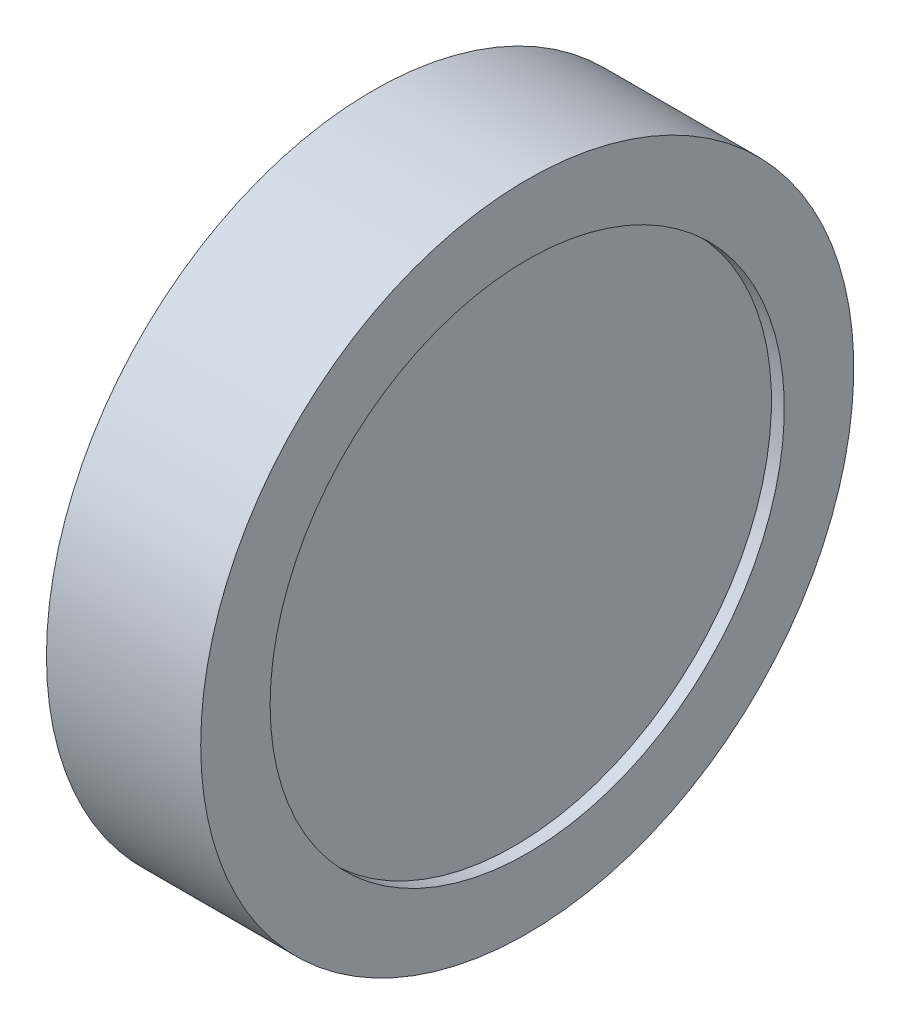
ISO-10303-21;
HEADER;
FILE_DESCRIPTION(('STEP AP214'),'2;1');
FILE_NAME('part.step','',(''),(''),'','','');
FILE_SCHEMA(('AUTOMOTIVE_DESIGN { 1 0 10303 214 1 1 1 1 }'));
ENDSEC;
DATA;
#1=APPLICATION_CONTEXT('core data for automotive mechanical design processes');
#2=APPLICATION_PROTOCOL_DEFINITION('international standard','automotive_design',2000,#1);
#3=PRODUCT_CONTEXT('',#1,'mechanical');
#4=PRODUCT('Part','Part','',(#3));
#5=PRODUCT_RELATED_PRODUCT_CATEGORY('part','',(#4));
#6=PRODUCT_DEFINITION_FORMATION('','',#4);
#7=PRODUCT_DEFINITION_CONTEXT('part definition',#1,'design');
#8=PRODUCT_DEFINITION('design','',#6,#7);
#9=PRODUCT_DEFINITION_SHAPE('','',#8);
#10=(LENGTH_UNIT() NAMED_UNIT(*) SI_UNIT(.MILLI.,.METRE.));
#11=(NAMED_UNIT(*) PLANE_ANGLE_UNIT() SI_UNIT($,.RADIAN.));
#12=(NAMED_UNIT(*) SI_UNIT($,.STERADIAN.) SOLID_ANGLE_UNIT());
#13=UNCERTAINTY_MEASURE_WITH_UNIT(LENGTH_MEASURE(1.E-05),#10,'distance_accuracy_value','');
#14=(GEOMETRIC_REPRESENTATION_CONTEXT(3) GLOBAL_UNCERTAINTY_ASSIGNED_CONTEXT((#13)) GLOBAL_UNIT_ASSIGNED_CONTEXT((#10,
#11,#12)) REPRESENTATION_CONTEXT('',''));
#15=CARTESIAN_POINT('',(0.,0.,0.));
#16=DIRECTION('',(0.,0.,1.));
#17=DIRECTION('',(1.,0.,0.));
#18=AXIS2_PLACEMENT_3D('',#15,#16,#17);
#19=CARTESIAN_POINT('',(2.5,10.,0.));
#20=DIRECTION('',(-1.,0.,0.));
#21=DIRECTION('',(0.,0.,1.));
#22=AXIS2_PLACEMENT_3D('',#19,#20,#21);
#23=PLANE('',#22);
#24=CARTESIAN_POINT('',(2.5,0.,0.));
#25=DIRECTION('',(-1.,0.,0.));
#26=DIRECTION('',(0.,0.,1.));
#27=AXIS2_PLACEMENT_3D('',#24,#25,#26);
#28=CIRCLE('',#27,10.);
#29=CARTESIAN_POINT('',(2.5,0.,10.));
#30=VERTEX_POINT('',#29);
#31=EDGE_CURVE('E10',#30,#30,#28,.T.);
#32=ORIENTED_EDGE('',*,*,#31,.F.);
#33=EDGE_LOOP('',(#32));
#34=FACE_BOUND('',#33,.T.);
#35=ADVANCED_FACE('F37',(#34),#23,.F.);
#36=CARTESIAN_POINT('',(-1.61421241885762,0.,0.));
#37=DIRECTION('',(-1.,0.,0.));
#38=DIRECTION('',(0.,0.,1.));
#39=AXIS2_PLACEMENT_3D('',#36,#37,#38);
#40=CYLINDRICAL_SURFACE('',#39,10.);
#41=CARTESIAN_POINT('',(3.,0.,0.));
#42=DIRECTION('',(-1.,0.,0.));
#43=DIRECTION('',(0.,0.,1.));
#44=AXIS2_PLACEMENT_3D('',#41,#42,#43);
#45=CIRCLE('',#44,10.);
#46=CARTESIAN_POINT('',(3.,0.,10.));
#47=VERTEX_POINT('',#46);
#48=EDGE_CURVE('E60',#47,#47,#45,.T.);
#49=ORIENTED_EDGE('',*,*,#48,.F.);
#50=EDGE_LOOP('',(#49));
#51=FACE_BOUND('',#50,.T.);
#52=ORIENTED_EDGE('',*,*,#31,.T.);
#53=EDGE_LOOP('',(#52));
#54=FACE_BOUND('',#53,.T.);
#55=ADVANCED_FACE('F90',(#51,#54),#40,.F.);
#56=CARTESIAN_POINT('',(-3.,0.,0.));
#57=DIRECTION('',(-1.,0.,0.));
#58=DIRECTION('',(0.,0.,1.));
#59=AXIS2_PLACEMENT_3D('',#56,#57,#58);
#60=CIRCLE('',#59,10.);
#61=CARTESIAN_POINT('',(-3.,0.,10.));
#62=VERTEX_POINT('',#61);
#63=EDGE_CURVE('E64',#62,#62,#60,.T.);
#64=ORIENTED_EDGE('',*,*,#63,.T.);
#65=EDGE_LOOP('',(#64));
#66=FACE_BOUND('',#65,.T.);
#67=CARTESIAN_POINT('',(-2.5,0.,0.));
#68=DIRECTION('',(1.,0.,0.));
#69=DIRECTION('',(0.,0.,-1.));
#70=AXIS2_PLACEMENT_3D('',#67,#68,#69);
#71=CIRCLE('',#70,10.);
#72=CARTESIAN_POINT('',(-2.5,0.,-10.));
#73=VERTEX_POINT('',#72);
#74=EDGE_CURVE('E44',#73,#73,#71,.T.);
#75=ORIENTED_EDGE('',*,*,#74,.T.);
#76=EDGE_LOOP('',(#75));
#77=FACE_BOUND('',#76,.T.);
#78=ADVANCED_FACE('F69',(#66,#77),#40,.F.);
#79=CARTESIAN_POINT('',(-3.,10.,0.));
#80=DIRECTION('',(1.,0.,0.));
#81=DIRECTION('',(0.,0.,-1.));
#82=AXIS2_PLACEMENT_3D('',#79,#80,#81);
#83=PLANE('',#82);
#84=ORIENTED_EDGE('',*,*,#63,.F.);
#85=EDGE_LOOP('',(#84));
#86=FACE_BOUND('',#85,.T.);
#87=CARTESIAN_POINT('',(-3.,0.,0.));
#88=DIRECTION('',(-1.,0.,0.));
#89=DIRECTION('',(0.,0.,1.));
#90=AXIS2_PLACEMENT_3D('',#87,#88,#89);
#91=CIRCLE('',#90,12.7);
#92=CARTESIAN_POINT('',(-3.,0.,12.7));
#93=VERTEX_POINT('',#92);
#94=EDGE_CURVE('E49',#93,#93,#91,.T.);
#95=ORIENTED_EDGE('',*,*,#94,.T.);
#96=EDGE_LOOP('',(#95));
#97=FACE_BOUND('',#96,.T.);
#98=ADVANCED_FACE('F71',(#86,#97),#83,.F.);
#99=CARTESIAN_POINT('',(-1.61421241885762,0.,0.));
#100=DIRECTION('',(-1.,0.,0.));
#101=DIRECTION('',(0.,0.,1.));
#102=AXIS2_PLACEMENT_3D('',#99,#100,#101);
#103=CYLINDRICAL_SURFACE('',#102,12.7);
#104=ORIENTED_EDGE('',*,*,#94,.F.);
#105=EDGE_LOOP('',(#104));
#106=FACE_BOUND('',#105,.T.);
#107=CARTESIAN_POINT('',(3.,0.,0.));
#108=DIRECTION('',(-1.,0.,0.));
#109=DIRECTION('',(0.,0.,1.));
#110=AXIS2_PLACEMENT_3D('',#107,#108,#109);
#111=CIRCLE('',#110,12.7);
#112=CARTESIAN_POINT('',(3.,0.,12.7));
#113=VERTEX_POINT('',#112);
#114=EDGE_CURVE('E54',#113,#113,#111,.T.);
#115=ORIENTED_EDGE('',*,*,#114,.T.);
#116=EDGE_LOOP('',(#115));
#117=FACE_BOUND('',#116,.T.);
#118=ADVANCED_FACE('F74',(#106,#117),#103,.T.);
#119=CARTESIAN_POINT('',(3.,12.7,0.));
#120=DIRECTION('',(-1.,0.,0.));
#121=DIRECTION('',(0.,0.,1.));
#122=AXIS2_PLACEMENT_3D('',#119,#120,#121);
#123=PLANE('',#122);
#124=ORIENTED_EDGE('',*,*,#114,.F.);
#125=EDGE_LOOP('',(#124));
#126=FACE_BOUND('',#125,.T.);
#127=ORIENTED_EDGE('',*,*,#48,.T.);
#128=EDGE_LOOP('',(#127));
#129=FACE_BOUND('',#128,.T.);
#130=ADVANCED_FACE('F80',(#126,#129),#123,.F.);
#131=CARTESIAN_POINT('',(-2.5,10.,0.));
#132=DIRECTION('',(1.,0.,0.));
#133=DIRECTION('',(0.,0.,-1.));
#134=AXIS2_PLACEMENT_3D('',#131,#132,#133);
#135=PLANE('',#134);
#136=ORIENTED_EDGE('',*,*,#74,.F.);
#137=EDGE_LOOP('',(#136));
#138=FACE_BOUND('',#137,.T.);
#139=ADVANCED_FACE('F86',(#138),#135,.F.);
#140=CLOSED_SHELL('',(#35,#55,#78,#98,#118,#130,#139));
#141=MANIFOLD_SOLID_BREP('B2',#140);
#142=ADVANCED_BREP_SHAPE_REPRESENTATION('',(#18,#141),#14);
#143=SHAPE_DEFINITION_REPRESENTATION(#9,#142);
ENDSEC;
END-ISO-10303-21;
